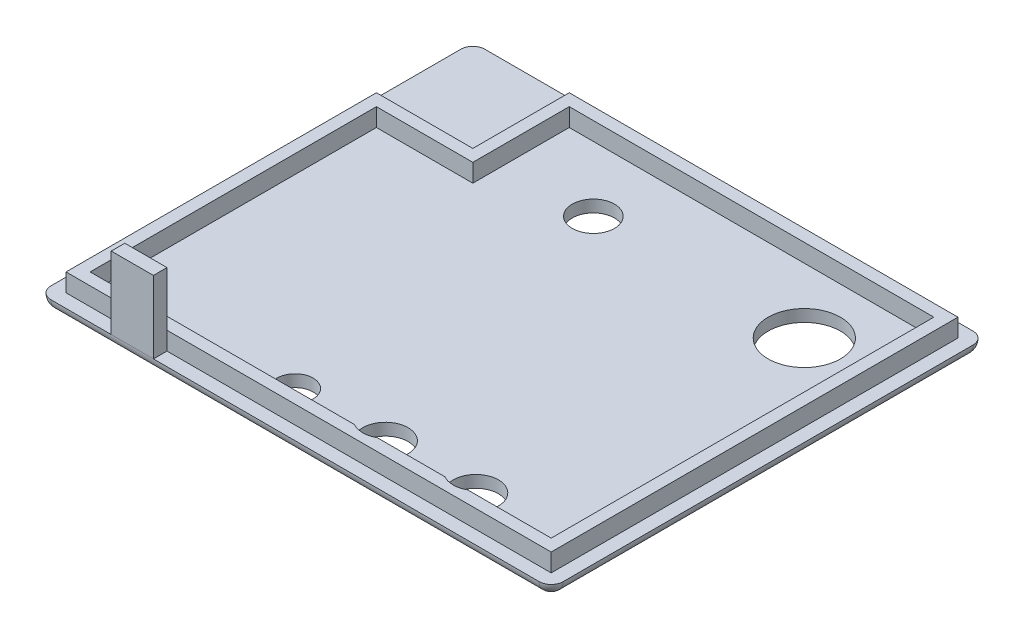
ISO-10303-21;
HEADER;
FILE_DESCRIPTION(('STEP AP214'),'2;1');
FILE_NAME('part.step','',(''),(''),'','','');
FILE_SCHEMA(('AUTOMOTIVE_DESIGN { 1 0 10303 214 1 1 1 1 }'));
ENDSEC;
DATA;
#1=APPLICATION_CONTEXT('core data for automotive mechanical design processes');
#2=APPLICATION_PROTOCOL_DEFINITION('international standard','automotive_design',2000,#1);
#3=PRODUCT_CONTEXT('',#1,'mechanical');
#4=PRODUCT('Part','Part','',(#3));
#5=PRODUCT_RELATED_PRODUCT_CATEGORY('part','',(#4));
#6=PRODUCT_DEFINITION_FORMATION('','',#4);
#7=PRODUCT_DEFINITION_CONTEXT('part definition',#1,'design');
#8=PRODUCT_DEFINITION('design','',#6,#7);
#9=PRODUCT_DEFINITION_SHAPE('','',#8);
#10=(LENGTH_UNIT() NAMED_UNIT(*) SI_UNIT(.MILLI.,.METRE.));
#11=(NAMED_UNIT(*) PLANE_ANGLE_UNIT() SI_UNIT($,.RADIAN.));
#12=(NAMED_UNIT(*) SI_UNIT($,.STERADIAN.) SOLID_ANGLE_UNIT());
#13=UNCERTAINTY_MEASURE_WITH_UNIT(LENGTH_MEASURE(1.E-05),#10,'distance_accuracy_value','');
#14=(GEOMETRIC_REPRESENTATION_CONTEXT(3) GLOBAL_UNCERTAINTY_ASSIGNED_CONTEXT((#13)) GLOBAL_UNIT_ASSIGNED_CONTEXT((#10,
#11,#12)) REPRESENTATION_CONTEXT('',''));
#15=CARTESIAN_POINT('',(0.,0.,0.));
#16=DIRECTION('',(0.,0.,1.));
#17=DIRECTION('',(1.,0.,0.));
#18=AXIS2_PLACEMENT_3D('',#15,#16,#17);
#19=CARTESIAN_POINT('',(0.,2.,0.));
#20=DIRECTION('',(0.,1.,0.));
#21=DIRECTION('',(0.,0.,1.));
#22=AXIS2_PLACEMENT_3D('',#19,#20,#21);
#23=PLANE('',#22);
#24=DIRECTION('',(1.,0.,0.));
#25=VECTOR('',#24,1.);
#26=CARTESIAN_POINT('',(-42.5,2.,36.));
#27=LINE('',#26,#25);
#28=CARTESIAN_POINT('',(-23.5,2.,36.));
#29=VERTEX_POINT('',#28);
#30=CARTESIAN_POINT('',(40.5,2.,36.));
#31=VERTEX_POINT('',#30);
#32=EDGE_CURVE('E385',#29,#31,#27,.T.);
#33=ORIENTED_EDGE('',*,*,#32,.T.);
#34=CARTESIAN_POINT('',(40.5,2.,34.));
#35=DIRECTION('',(0.,1.,0.));
#36=DIRECTION('',(0.,0.,1.));
#37=AXIS2_PLACEMENT_3D('',#34,#35,#36);
#38=CIRCLE('',#37,2.);
#39=CARTESIAN_POINT('',(42.5,2.,34.));
#40=VERTEX_POINT('',#39);
#41=EDGE_CURVE('E409',#31,#40,#38,.T.);
#42=ORIENTED_EDGE('',*,*,#41,.T.);
#43=DIRECTION('',(0.,0.,-1.));
#44=VECTOR('',#43,1.);
#45=CARTESIAN_POINT('',(42.5,2.,-36.));
#46=LINE('',#45,#44);
#47=CARTESIAN_POINT('',(42.5,2.,-34.));
#48=VERTEX_POINT('',#47);
#49=EDGE_CURVE('E388',#40,#48,#46,.T.);
#50=ORIENTED_EDGE('',*,*,#49,.T.);
#51=CARTESIAN_POINT('',(40.5,2.,-34.));
#52=DIRECTION('',(0.,1.,0.));
#53=DIRECTION('',(0.,0.,1.));
#54=AXIS2_PLACEMENT_3D('',#51,#52,#53);
#55=CIRCLE('',#54,2.);
#56=CARTESIAN_POINT('',(40.5,2.,-36.));
#57=VERTEX_POINT('',#56);
#58=EDGE_CURVE('E403',#48,#57,#55,.T.);
#59=ORIENTED_EDGE('',*,*,#58,.T.);
#60=DIRECTION('',(-1.,0.,0.));
#61=VECTOR('',#60,1.);
#62=CARTESIAN_POINT('',(-42.5,2.,-36.));
#63=LINE('',#62,#61);
#64=CARTESIAN_POINT('',(-40.5,2.,-36.));
#65=VERTEX_POINT('',#64);
#66=EDGE_CURVE('E390',#57,#65,#63,.T.);
#67=ORIENTED_EDGE('',*,*,#66,.T.);
#68=CARTESIAN_POINT('',(-40.5,2.,-34.));
#69=DIRECTION('',(0.,1.,0.));
#70=DIRECTION('',(0.,0.,1.));
#71=AXIS2_PLACEMENT_3D('',#68,#69,#70);
#72=CIRCLE('',#71,2.);
#73=CARTESIAN_POINT('',(-42.5,2.,-34.));
#74=VERTEX_POINT('',#73);
#75=EDGE_CURVE('E405',#65,#74,#72,.T.);
#76=ORIENTED_EDGE('',*,*,#75,.T.);
#77=DIRECTION('',(0.,0.,1.));
#78=VECTOR('',#77,1.);
#79=CARTESIAN_POINT('',(-42.5,2.,-36.));
#80=LINE('',#79,#78);
#81=CARTESIAN_POINT('',(-42.5,2.,34.));
#82=VERTEX_POINT('',#81);
#83=EDGE_CURVE('E383',#74,#82,#80,.T.);
#84=ORIENTED_EDGE('',*,*,#83,.T.);
#85=CARTESIAN_POINT('',(-40.5,2.,34.));
#86=DIRECTION('',(0.,1.,0.));
#87=DIRECTION('',(0.,0.,1.));
#88=AXIS2_PLACEMENT_3D('',#85,#86,#87);
#89=CIRCLE('',#88,2.);
#90=CARTESIAN_POINT('',(-40.5,2.,36.));
#91=VERTEX_POINT('',#90);
#92=EDGE_CURVE('E407',#82,#91,#89,.T.);
#93=ORIENTED_EDGE('',*,*,#92,.T.);
#94=CARTESIAN_POINT('',(-30.5,2.,36.));
#95=VERTEX_POINT('',#94);
#96=EDGE_CURVE('E386',#91,#95,#27,.T.);
#97=ORIENTED_EDGE('',*,*,#96,.T.);
#98=DIRECTION('',(0.,0.,1.));
#99=VECTOR('',#98,1.);
#100=CARTESIAN_POINT('',(-30.5,2.,33.75));
#101=LINE('',#100,#99);
#102=CARTESIAN_POINT('',(-30.5,2.,33.75));
#103=VERTEX_POINT('',#102);
#104=EDGE_CURVE('E243',#103,#95,#101,.T.);
#105=ORIENTED_EDGE('',*,*,#104,.F.);
#106=DIRECTION('',(1.,0.,0.));
#107=VECTOR('',#106,1.);
#108=CARTESIAN_POINT('',(40.25,2.,33.75));
#109=LINE('',#108,#107);
#110=CARTESIAN_POINT('',(-40.25,2.,33.75));
#111=VERTEX_POINT('',#110);
#112=EDGE_CURVE('E340',#111,#103,#109,.T.);
#113=ORIENTED_EDGE('',*,*,#112,.F.);
#114=DIRECTION('',(0.,0.,1.));
#115=VECTOR('',#114,1.);
#116=CARTESIAN_POINT('',(-40.25,2.,-17.75));
#117=LINE('',#116,#115);
#118=CARTESIAN_POINT('',(-40.25,2.,-17.75));
#119=VERTEX_POINT('',#118);
#120=EDGE_CURVE('E362',#119,#111,#117,.T.);
#121=ORIENTED_EDGE('',*,*,#120,.F.);
#122=DIRECTION('',(-1.,0.,0.));
#123=VECTOR('',#122,1.);
#124=CARTESIAN_POINT('',(-24.25,2.,-17.75));
#125=LINE('',#124,#123);
#126=CARTESIAN_POINT('',(-24.25,2.,-17.75));
#127=VERTEX_POINT('',#126);
#128=EDGE_CURVE('E360',#127,#119,#125,.T.);
#129=ORIENTED_EDGE('',*,*,#128,.F.);
#130=DIRECTION('',(0.,0.,1.));
#131=VECTOR('',#130,1.);
#132=CARTESIAN_POINT('',(-24.25,2.,-33.75));
#133=LINE('',#132,#131);
#134=CARTESIAN_POINT('',(-24.25,2.,-33.75));
#135=VERTEX_POINT('',#134);
#136=EDGE_CURVE('E358',#135,#127,#133,.T.);
#137=ORIENTED_EDGE('',*,*,#136,.F.);
#138=DIRECTION('',(-1.,0.,0.));
#139=VECTOR('',#138,1.);
#140=CARTESIAN_POINT('',(-24.25,2.,-33.75));
#141=LINE('',#140,#139);
#142=CARTESIAN_POINT('',(40.25,2.,-33.75));
#143=VERTEX_POINT('',#142);
#144=EDGE_CURVE('E356',#143,#135,#141,.T.);
#145=ORIENTED_EDGE('',*,*,#144,.F.);
#146=DIRECTION('',(0.,0.,-1.));
#147=VECTOR('',#146,1.);
#148=CARTESIAN_POINT('',(40.25,2.,-33.75));
#149=LINE('',#148,#147);
#150=CARTESIAN_POINT('',(40.25,2.,33.75));
#151=VERTEX_POINT('',#150);
#152=EDGE_CURVE('E335',#151,#143,#149,.T.);
#153=ORIENTED_EDGE('',*,*,#152,.F.);
#154=CARTESIAN_POINT('',(-23.5,2.,33.75));
#155=VERTEX_POINT('',#154);
#156=EDGE_CURVE('E365',#155,#151,#109,.T.);
#157=ORIENTED_EDGE('',*,*,#156,.F.);
#158=DIRECTION('',(0.,0.,-1.));
#159=VECTOR('',#158,1.);
#160=CARTESIAN_POINT('',(-23.5,2.,33.75));
#161=LINE('',#160,#159);
#162=EDGE_CURVE('E239',#29,#155,#161,.T.);
#163=ORIENTED_EDGE('',*,*,#162,.F.);
#164=EDGE_LOOP('',(#33,#42,#50,#59,#67,#76,#84,#93,#97,#105,#113,#121,#129,#137,#145,#153,#157,#163));
#165=FACE_BOUND('',#164,.T.);
#166=ADVANCED_FACE('F37',(#165),#23,.T.);
#167=CARTESIAN_POINT('',(40.25,5.,33.75));
#168=DIRECTION('',(0.,0.,-1.));
#169=DIRECTION('',(-1.,0.,0.));
#170=AXIS2_PLACEMENT_3D('',#167,#168,#169);
#171=PLANE('',#170);
#172=DIRECTION('',(0.,-1.,0.));
#173=VECTOR('',#172,1.);
#174=CARTESIAN_POINT('',(-30.5,5.,33.75));
#175=LINE('',#174,#173);
#176=CARTESIAN_POINT('',(-30.5,5.,33.75));
#177=VERTEX_POINT('',#176);
#178=EDGE_CURVE('E401',#177,#103,#175,.T.);
#179=ORIENTED_EDGE('',*,*,#178,.F.);
#180=DIRECTION('',(1.,0.,0.));
#181=VECTOR('',#180,1.);
#182=CARTESIAN_POINT('',(40.25,5.,33.75));
#183=LINE('',#182,#181);
#184=CARTESIAN_POINT('',(-40.25,5.,33.75));
#185=VERTEX_POINT('',#184);
#186=EDGE_CURVE('E349',#185,#177,#183,.T.);
#187=ORIENTED_EDGE('',*,*,#186,.F.);
#188=DIRECTION('',(0.,-1.,0.));
#189=VECTOR('',#188,1.);
#190=CARTESIAN_POINT('',(-40.25,5.,33.75));
#191=LINE('',#190,#189);
#192=EDGE_CURVE('E370',#185,#111,#191,.T.);
#193=ORIENTED_EDGE('',*,*,#192,.T.);
#194=ORIENTED_EDGE('',*,*,#112,.T.);
#195=EDGE_LOOP('',(#179,#187,#193,#194));
#196=FACE_BOUND('',#195,.T.);
#197=ADVANCED_FACE('F477',(#196),#171,.F.);
#198=DIRECTION('',(0.,1.,0.));
#199=VECTOR('',#198,1.);
#200=CARTESIAN_POINT('',(-23.5,5.,33.75));
#201=LINE('',#200,#199);
#202=CARTESIAN_POINT('',(-23.5,5.,33.75));
#203=VERTEX_POINT('',#202);
#204=EDGE_CURVE('E398',#155,#203,#201,.T.);
#205=ORIENTED_EDGE('',*,*,#204,.F.);
#206=ORIENTED_EDGE('',*,*,#156,.T.);
#207=DIRECTION('',(0.,-1.,0.));
#208=VECTOR('',#207,1.);
#209=CARTESIAN_POINT('',(40.25,5.,33.75));
#210=LINE('',#209,#208);
#211=CARTESIAN_POINT('',(40.25,5.,33.75));
#212=VERTEX_POINT('',#211);
#213=EDGE_CURVE('E352',#212,#151,#210,.T.);
#214=ORIENTED_EDGE('',*,*,#213,.F.);
#215=EDGE_CURVE('E348',#203,#212,#183,.T.);
#216=ORIENTED_EDGE('',*,*,#215,.F.);
#217=EDGE_LOOP('',(#205,#206,#214,#216));
#218=FACE_BOUND('',#217,.T.);
#219=ADVANCED_FACE('F459',(#218),#171,.F.);
#220=CARTESIAN_POINT('',(-38.25,5.,31.75));
#221=DIRECTION('',(0.,0.,-1.));
#222=DIRECTION('',(-1.,0.,0.));
#223=AXIS2_PLACEMENT_3D('',#220,#221,#222);
#224=PLANE('',#223);
#225=DIRECTION('',(0.,-1.,0.));
#226=VECTOR('',#225,1.);
#227=CARTESIAN_POINT('',(24.370828693387,5.,31.75));
#228=LINE('',#227,#226);
#229=CARTESIAN_POINT('',(24.370828693387,5.,31.75));
#230=VERTEX_POINT('',#229);
#231=CARTESIAN_POINT('',(24.370828693387,2.,31.75));
#232=VERTEX_POINT('',#231);
#233=EDGE_CURVE('E284',#230,#232,#228,.T.);
#234=ORIENTED_EDGE('',*,*,#233,.F.);
#235=DIRECTION('',(1.,0.,0.));
#236=VECTOR('',#235,1.);
#237=CARTESIAN_POINT('',(-38.25,5.,31.75));
#238=LINE('',#237,#236);
#239=CARTESIAN_POINT('',(38.25,5.,31.75));
#240=VERTEX_POINT('',#239);
#241=EDGE_CURVE('E289',#230,#240,#238,.T.);
#242=ORIENTED_EDGE('',*,*,#241,.T.);
#243=DIRECTION('',(0.,-1.,0.));
#244=VECTOR('',#243,1.);
#245=CARTESIAN_POINT('',(38.25,5.,31.75));
#246=LINE('',#245,#244);
#247=CARTESIAN_POINT('',(38.25,2.,31.75));
#248=VERTEX_POINT('',#247);
#249=EDGE_CURVE('E329',#240,#248,#246,.T.);
#250=ORIENTED_EDGE('',*,*,#249,.T.);
#251=DIRECTION('',(1.,0.,0.));
#252=VECTOR('',#251,1.);
#253=CARTESIAN_POINT('',(-38.25,2.,31.75));
#254=LINE('',#253,#252);
#255=EDGE_CURVE('E306',#232,#248,#254,.T.);
#256=ORIENTED_EDGE('',*,*,#255,.F.);
#257=EDGE_LOOP('',(#234,#242,#250,#256));
#258=FACE_BOUND('',#257,.T.);
#259=ADVANCED_FACE('F599',(#258),#224,.T.);
#260=DIRECTION('',(0.,-1.,0.));
#261=VECTOR('',#260,1.);
#262=CARTESIAN_POINT('',(20.629171306613,5.,31.75));
#263=LINE('',#262,#261);
#264=CARTESIAN_POINT('',(20.629171306613,2.,31.75));
#265=VERTEX_POINT('',#264);
#266=CARTESIAN_POINT('',(20.629171306613,5.,31.75));
#267=VERTEX_POINT('',#266);
#268=EDGE_CURVE('E282',#265,#267,#263,.F.);
#269=ORIENTED_EDGE('',*,*,#268,.F.);
#270=CARTESIAN_POINT('',(9.37082869338696,2.,31.75));
#271=VERTEX_POINT('',#270);
#272=EDGE_CURVE('E311',#271,#265,#254,.T.);
#273=ORIENTED_EDGE('',*,*,#272,.F.);
#274=DIRECTION('',(0.,-1.,0.));
#275=VECTOR('',#274,1.);
#276=CARTESIAN_POINT('',(9.37082869338696,5.,31.75));
#277=LINE('',#276,#275);
#278=CARTESIAN_POINT('',(9.37082869338696,5.,31.75));
#279=VERTEX_POINT('',#278);
#280=EDGE_CURVE('E280',#279,#271,#277,.T.);
#281=ORIENTED_EDGE('',*,*,#280,.F.);
#282=EDGE_CURVE('E295',#279,#267,#238,.T.);
#283=ORIENTED_EDGE('',*,*,#282,.T.);
#284=EDGE_LOOP('',(#269,#273,#281,#283));
#285=FACE_BOUND('',#284,.T.);
#286=ADVANCED_FACE('F541',(#285),#224,.T.);
#287=CARTESIAN_POINT('',(-42.5,2.,36.));
#288=DIRECTION('',(0.,0.,-1.));
#289=DIRECTION('',(-1.,0.,0.));
#290=AXIS2_PLACEMENT_3D('',#287,#288,#289);
#291=PLANE('',#290);
#292=DIRECTION('',(0.,-1.,0.));
#293=VECTOR('',#292,1.);
#294=CARTESIAN_POINT('',(-30.5,14.,36.));
#295=LINE('',#294,#293);
#296=CARTESIAN_POINT('',(-30.5,14.,36.));
#297=VERTEX_POINT('',#296);
#298=EDGE_CURVE('E223',#297,#95,#295,.T.);
#299=ORIENTED_EDGE('',*,*,#298,.T.);
#300=DIRECTION('',(1.,0.,0.));
#301=VECTOR('',#300,1.);
#302=CARTESIAN_POINT('',(-42.5,2.,36.));
#303=LINE('',#302,#301);
#304=EDGE_CURVE('E412',#95,#29,#303,.T.);
#305=ORIENTED_EDGE('',*,*,#304,.T.);
#306=DIRECTION('',(0.,-1.,0.));
#307=VECTOR('',#306,1.);
#308=CARTESIAN_POINT('',(-23.5,14.,36.));
#309=LINE('',#308,#307);
#310=CARTESIAN_POINT('',(-23.5,14.,36.));
#311=VERTEX_POINT('',#310);
#312=EDGE_CURVE('E226',#311,#29,#309,.T.);
#313=ORIENTED_EDGE('',*,*,#312,.F.);
#314=DIRECTION('',(1.,0.,0.));
#315=VECTOR('',#314,1.);
#316=CARTESIAN_POINT('',(-30.5,14.,36.));
#317=LINE('',#316,#315);
#318=EDGE_CURVE('E219',#297,#311,#317,.T.);
#319=ORIENTED_EDGE('',*,*,#318,.F.);
#320=EDGE_LOOP('',(#299,#305,#313,#319));
#321=FACE_BOUND('',#320,.T.);
#322=ADVANCED_FACE('F221',(#321),#291,.F.);
#323=CARTESIAN_POINT('',(0.,0.,0.));
#324=DIRECTION('',(0.,1.,0.));
#325=DIRECTION('',(0.,0.,1.));
#326=AXIS2_PLACEMENT_3D('',#323,#324,#325);
#327=PLANE('',#326);
#328=DIRECTION('',(0.,0.,-1.));
#329=VECTOR('',#328,1.);
#330=CARTESIAN_POINT('',(40.5,0.,0.));
#331=LINE('',#330,#329);
#332=CARTESIAN_POINT('',(40.5,0.,-34.));
#333=VERTEX_POINT('',#332);
#334=CARTESIAN_POINT('',(40.5,0.,34.));
#335=VERTEX_POINT('',#334);
#336=EDGE_CURVE('E414',#333,#335,#331,.F.);
#337=ORIENTED_EDGE('',*,*,#336,.T.);
#338=DIRECTION('',(1.,0.,0.));
#339=VECTOR('',#338,1.);
#340=CARTESIAN_POINT('',(0.,0.,34.));
#341=LINE('',#340,#339);
#342=CARTESIAN_POINT('',(-40.5,0.,34.));
#343=VERTEX_POINT('',#342);
#344=EDGE_CURVE('E11',#335,#343,#341,.F.);
#345=ORIENTED_EDGE('',*,*,#344,.T.);
#346=DIRECTION('',(0.,0.,1.));
#347=VECTOR('',#346,1.);
#348=CARTESIAN_POINT('',(-40.5,0.,0.));
#349=LINE('',#348,#347);
#350=CARTESIAN_POINT('',(-40.5,0.,-34.));
#351=VERTEX_POINT('',#350);
#352=EDGE_CURVE('E46',#343,#351,#349,.F.);
#353=ORIENTED_EDGE('',*,*,#352,.T.);
#354=DIRECTION('',(-1.,0.,0.));
#355=VECTOR('',#354,1.);
#356=CARTESIAN_POINT('',(0.,0.,-34.));
#357=LINE('',#356,#355);
#358=EDGE_CURVE('E416',#351,#333,#357,.F.);
#359=ORIENTED_EDGE('',*,*,#358,.T.);
#360=EDGE_LOOP('',(#337,#345,#353,#359));
#361=FACE_BOUND('',#360,.T.);
#362=CARTESIAN_POINT('',(27.5,0.,-21.));
#363=DIRECTION('',(0.,-1.,0.));
#364=DIRECTION('',(0.,0.,-1.));
#365=AXIS2_PLACEMENT_3D('',#362,#363,#364);
#366=CIRCLE('',#365,6.);
#367=CARTESIAN_POINT('',(27.5,0.,-27.));
#368=VERTEX_POINT('',#367);
#369=EDGE_CURVE('E258',#368,#368,#366,.T.);
#370=ORIENTED_EDGE('',*,*,#369,.F.);
#371=EDGE_LOOP('',(#370));
#372=FACE_BOUND('',#371,.T.);
#373=CARTESIAN_POINT('',(-7.5,0.,-21.));
#374=DIRECTION('',(0.,-1.,0.));
#375=DIRECTION('',(0.,0.,-1.));
#376=AXIS2_PLACEMENT_3D('',#373,#374,#375);
#377=CIRCLE('',#376,3.5);
#378=CARTESIAN_POINT('',(-7.5,0.,-24.5));
#379=VERTEX_POINT('',#378);
#380=EDGE_CURVE('E248',#379,#379,#377,.T.);
#381=ORIENTED_EDGE('',*,*,#380,.F.);
#382=EDGE_LOOP('',(#381));
#383=FACE_BOUND('',#382,.T.);
#384=CARTESIAN_POINT('',(22.5,0.,28.5));
#385=DIRECTION('',(0.,-1.,0.));
#386=DIRECTION('',(0.,0.,-1.));
#387=AXIS2_PLACEMENT_3D('',#384,#385,#386);
#388=CIRCLE('',#387,3.75);
#389=CARTESIAN_POINT('',(22.5,0.,24.75));
#390=VERTEX_POINT('',#389);
#391=EDGE_CURVE('E267',#390,#390,#388,.T.);
#392=ORIENTED_EDGE('',*,*,#391,.F.);
#393=EDGE_LOOP('',(#392));
#394=FACE_BOUND('',#393,.T.);
#395=CARTESIAN_POINT('',(7.5,0.,28.5));
#396=DIRECTION('',(0.,-1.,0.));
#397=DIRECTION('',(0.,0.,-1.));
#398=AXIS2_PLACEMENT_3D('',#395,#396,#397);
#399=CIRCLE('',#398,3.75);
#400=CARTESIAN_POINT('',(7.5,0.,24.75));
#401=VERTEX_POINT('',#400);
#402=EDGE_CURVE('E270',#401,#401,#399,.T.);
#403=ORIENTED_EDGE('',*,*,#402,.F.);
#404=EDGE_LOOP('',(#403));
#405=FACE_BOUND('',#404,.T.);
#406=CARTESIAN_POINT('',(-7.5,0.,28.5));
#407=DIRECTION('',(0.,-1.,0.));
#408=DIRECTION('',(0.,0.,-1.));
#409=AXIS2_PLACEMENT_3D('',#406,#407,#408);
#410=CIRCLE('',#409,3.);
#411=CARTESIAN_POINT('',(-7.5,0.,25.5));
#412=VERTEX_POINT('',#411);
#413=EDGE_CURVE('E257',#412,#412,#410,.T.);
#414=ORIENTED_EDGE('',*,*,#413,.F.);
#415=EDGE_LOOP('',(#414));
#416=FACE_BOUND('',#415,.T.);
#417=ADVANCED_FACE('F500',(#361,#372,#383,#394,#405,#416),#327,.F.);
#418=CARTESIAN_POINT('',(0.,5.,0.));
#419=DIRECTION('',(0.,-1.,0.));
#420=DIRECTION('',(0.,0.,-1.));
#421=AXIS2_PLACEMENT_3D('',#418,#419,#420);
#422=PLANE('',#421);
#423=DIRECTION('',(0.,0.,-1.));
#424=VECTOR('',#423,1.);
#425=CARTESIAN_POINT('',(40.25,5.,-33.75));
#426=LINE('',#425,#424);
#427=CARTESIAN_POINT('',(40.25,5.,-33.75));
#428=VERTEX_POINT('',#427);
#429=EDGE_CURVE('E336',#212,#428,#426,.T.);
#430=ORIENTED_EDGE('',*,*,#429,.T.);
#431=DIRECTION('',(-1.,0.,0.));
#432=VECTOR('',#431,1.);
#433=CARTESIAN_POINT('',(-24.25,5.,-33.75));
#434=LINE('',#433,#432);
#435=CARTESIAN_POINT('',(-24.25,5.,-33.75));
#436=VERTEX_POINT('',#435);
#437=EDGE_CURVE('E339',#428,#436,#434,.T.);
#438=ORIENTED_EDGE('',*,*,#437,.T.);
#439=DIRECTION('',(0.,0.,1.));
#440=VECTOR('',#439,1.);
#441=CARTESIAN_POINT('',(-24.25,5.,-33.75));
#442=LINE('',#441,#440);
#443=CARTESIAN_POINT('',(-24.25,5.,-17.75));
#444=VERTEX_POINT('',#443);
#445=EDGE_CURVE('E342',#436,#444,#442,.T.);
#446=ORIENTED_EDGE('',*,*,#445,.T.);
#447=DIRECTION('',(-1.,0.,0.));
#448=VECTOR('',#447,1.);
#449=CARTESIAN_POINT('',(-24.25,5.,-17.75));
#450=LINE('',#449,#448);
#451=CARTESIAN_POINT('',(-40.25,5.,-17.75));
#452=VERTEX_POINT('',#451);
#453=EDGE_CURVE('E344',#444,#452,#450,.T.);
#454=ORIENTED_EDGE('',*,*,#453,.T.);
#455=DIRECTION('',(0.,0.,1.));
#456=VECTOR('',#455,1.);
#457=CARTESIAN_POINT('',(-40.25,5.,-17.75));
#458=LINE('',#457,#456);
#459=EDGE_CURVE('E346',#452,#185,#458,.T.);
#460=ORIENTED_EDGE('',*,*,#459,.T.);
#461=ORIENTED_EDGE('',*,*,#186,.T.);
#462=EDGE_CURVE('E353',#177,#203,#183,.T.);
#463=ORIENTED_EDGE('',*,*,#462,.T.);
#464=ORIENTED_EDGE('',*,*,#215,.T.);
#465=EDGE_LOOP('',(#430,#438,#446,#454,#460,#461,#463,#464));
#466=FACE_BOUND('',#465,.T.);
#467=ORIENTED_EDGE('',*,*,#241,.F.);
#468=CARTESIAN_POINT('',(22.5,5.,28.5));
#469=DIRECTION('',(0.,-1.,0.));
#470=DIRECTION('',(0.,0.,-1.));
#471=AXIS2_PLACEMENT_3D('',#468,#469,#470);
#472=CIRCLE('',#471,3.75);
#473=EDGE_CURVE('E263',#230,#267,#472,.T.);
#474=ORIENTED_EDGE('',*,*,#473,.T.);
#475=ORIENTED_EDGE('',*,*,#282,.F.);
#476=CARTESIAN_POINT('',(7.5,5.,28.5));
#477=DIRECTION('',(0.,-1.,0.));
#478=DIRECTION('',(0.,0.,-1.));
#479=AXIS2_PLACEMENT_3D('',#476,#477,#478);
#480=CIRCLE('',#479,3.75);
#481=CARTESIAN_POINT('',(5.62917130661304,5.,31.75));
#482=VERTEX_POINT('',#481);
#483=EDGE_CURVE('E273',#279,#482,#480,.T.);
#484=ORIENTED_EDGE('',*,*,#483,.T.);
#485=CARTESIAN_POINT('',(-38.25,5.,31.75));
#486=VERTEX_POINT('',#485);
#487=EDGE_CURVE('E291',#486,#482,#238,.T.);
#488=ORIENTED_EDGE('',*,*,#487,.F.);
#489=DIRECTION('',(0.,0.,1.));
#490=VECTOR('',#489,1.);
#491=CARTESIAN_POINT('',(-38.25,5.,-15.75));
#492=LINE('',#491,#490);
#493=CARTESIAN_POINT('',(-38.25,5.,-15.75));
#494=VERTEX_POINT('',#493);
#495=EDGE_CURVE('E287',#494,#486,#492,.T.);
#496=ORIENTED_EDGE('',*,*,#495,.F.);
#497=DIRECTION('',(-1.,0.,0.));
#498=VECTOR('',#497,1.);
#499=CARTESIAN_POINT('',(-22.25,5.,-15.75));
#500=LINE('',#499,#498);
#501=CARTESIAN_POINT('',(-22.25,5.,-15.75));
#502=VERTEX_POINT('',#501);
#503=EDGE_CURVE('E302',#502,#494,#500,.T.);
#504=ORIENTED_EDGE('',*,*,#503,.F.);
#505=DIRECTION('',(0.,0.,1.));
#506=VECTOR('',#505,1.);
#507=CARTESIAN_POINT('',(-22.25,5.,-31.75));
#508=LINE('',#507,#506);
#509=CARTESIAN_POINT('',(-22.25,5.,-31.75));
#510=VERTEX_POINT('',#509);
#511=EDGE_CURVE('E299',#510,#502,#508,.T.);
#512=ORIENTED_EDGE('',*,*,#511,.F.);
#513=DIRECTION('',(-1.,0.,0.));
#514=VECTOR('',#513,1.);
#515=CARTESIAN_POINT('',(38.25,5.,-31.75));
#516=LINE('',#515,#514);
#517=CARTESIAN_POINT('',(38.25,5.,-31.75));
#518=VERTEX_POINT('',#517);
#519=EDGE_CURVE('E297',#518,#510,#516,.T.);
#520=ORIENTED_EDGE('',*,*,#519,.F.);
#521=DIRECTION('',(0.,0.,-1.));
#522=VECTOR('',#521,1.);
#523=CARTESIAN_POINT('',(38.25,5.,31.75));
#524=LINE('',#523,#522);
#525=EDGE_CURVE('E294',#240,#518,#524,.T.);
#526=ORIENTED_EDGE('',*,*,#525,.F.);
#527=EDGE_LOOP('',(#467,#474,#475,#484,#488,#496,#504,#512,#520,#526));
#528=FACE_BOUND('',#527,.T.);
#529=ADVANCED_FACE('F470',(#466,#528),#422,.F.);
#530=CARTESIAN_POINT('',(40.25,5.,-33.75));
#531=DIRECTION('',(-1.,0.,0.));
#532=DIRECTION('',(0.,0.,1.));
#533=AXIS2_PLACEMENT_3D('',#530,#531,#532);
#534=PLANE('',#533);
#535=ORIENTED_EDGE('',*,*,#152,.T.);
#536=DIRECTION('',(0.,-1.,0.));
#537=VECTOR('',#536,1.);
#538=CARTESIAN_POINT('',(40.25,5.,-33.75));
#539=LINE('',#538,#537);
#540=EDGE_CURVE('E381',#428,#143,#539,.T.);
#541=ORIENTED_EDGE('',*,*,#540,.F.);
#542=ORIENTED_EDGE('',*,*,#429,.F.);
#543=ORIENTED_EDGE('',*,*,#213,.T.);
#544=EDGE_LOOP('',(#535,#541,#542,#543));
#545=FACE_BOUND('',#544,.T.);
#546=ADVANCED_FACE('F467',(#545),#534,.F.);
#547=CARTESIAN_POINT('',(-24.25,5.,-33.75));
#548=DIRECTION('',(0.,0.,1.));
#549=DIRECTION('',(1.,0.,0.));
#550=AXIS2_PLACEMENT_3D('',#547,#548,#549);
#551=PLANE('',#550);
#552=ORIENTED_EDGE('',*,*,#144,.T.);
#553=DIRECTION('',(0.,-1.,0.));
#554=VECTOR('',#553,1.);
#555=CARTESIAN_POINT('',(-24.25,5.,-33.75));
#556=LINE('',#555,#554);
#557=EDGE_CURVE('E378',#436,#135,#556,.T.);
#558=ORIENTED_EDGE('',*,*,#557,.F.);
#559=ORIENTED_EDGE('',*,*,#437,.F.);
#560=ORIENTED_EDGE('',*,*,#540,.T.);
#561=EDGE_LOOP('',(#552,#558,#559,#560));
#562=FACE_BOUND('',#561,.T.);
#563=ADVANCED_FACE('F661',(#562),#551,.F.);
#564=CARTESIAN_POINT('',(-24.25,5.,-33.75));
#565=DIRECTION('',(1.,0.,0.));
#566=DIRECTION('',(0.,0.,-1.));
#567=AXIS2_PLACEMENT_3D('',#564,#565,#566);
#568=PLANE('',#567);
#569=ORIENTED_EDGE('',*,*,#136,.T.);
#570=DIRECTION('',(0.,-1.,0.));
#571=VECTOR('',#570,1.);
#572=CARTESIAN_POINT('',(-24.25,5.,-17.75));
#573=LINE('',#572,#571);
#574=EDGE_CURVE('E375',#444,#127,#573,.T.);
#575=ORIENTED_EDGE('',*,*,#574,.F.);
#576=ORIENTED_EDGE('',*,*,#445,.F.);
#577=ORIENTED_EDGE('',*,*,#557,.T.);
#578=EDGE_LOOP('',(#569,#575,#576,#577));
#579=FACE_BOUND('',#578,.T.);
#580=ADVANCED_FACE('F658',(#579),#568,.F.);
#581=CARTESIAN_POINT('',(-24.25,5.,-17.75));
#582=DIRECTION('',(0.,0.,1.));
#583=DIRECTION('',(1.,0.,0.));
#584=AXIS2_PLACEMENT_3D('',#581,#582,#583);
#585=PLANE('',#584);
#586=ORIENTED_EDGE('',*,*,#128,.T.);
#587=DIRECTION('',(0.,-1.,0.));
#588=VECTOR('',#587,1.);
#589=CARTESIAN_POINT('',(-40.25,5.,-17.75));
#590=LINE('',#589,#588);
#591=EDGE_CURVE('E372',#452,#119,#590,.T.);
#592=ORIENTED_EDGE('',*,*,#591,.F.);
#593=ORIENTED_EDGE('',*,*,#453,.F.);
#594=ORIENTED_EDGE('',*,*,#574,.T.);
#595=EDGE_LOOP('',(#586,#592,#593,#594));
#596=FACE_BOUND('',#595,.T.);
#597=ADVANCED_FACE('F650',(#596),#585,.F.);
#598=CARTESIAN_POINT('',(-40.25,5.,-17.75));
#599=DIRECTION('',(1.,0.,0.));
#600=DIRECTION('',(0.,0.,-1.));
#601=AXIS2_PLACEMENT_3D('',#598,#599,#600);
#602=PLANE('',#601);
#603=ORIENTED_EDGE('',*,*,#120,.T.);
#604=ORIENTED_EDGE('',*,*,#192,.F.);
#605=ORIENTED_EDGE('',*,*,#459,.F.);
#606=ORIENTED_EDGE('',*,*,#591,.T.);
#607=EDGE_LOOP('',(#603,#604,#605,#606));
#608=FACE_BOUND('',#607,.T.);
#609=ADVANCED_FACE('F646',(#608),#602,.F.);
#610=CARTESIAN_POINT('',(-38.25,5.,-15.75));
#611=DIRECTION('',(1.,0.,0.));
#612=DIRECTION('',(0.,0.,-1.));
#613=AXIS2_PLACEMENT_3D('',#610,#611,#612);
#614=PLANE('',#613);
#615=DIRECTION('',(0.,0.,1.));
#616=VECTOR('',#615,1.);
#617=CARTESIAN_POINT('',(-38.25,2.,-15.75));
#618=LINE('',#617,#616);
#619=CARTESIAN_POINT('',(-38.25,2.,-15.75));
#620=VERTEX_POINT('',#619);
#621=CARTESIAN_POINT('',(-38.25,2.,31.75));
#622=VERTEX_POINT('',#621);
#623=EDGE_CURVE('E286',#620,#622,#618,.T.);
#624=ORIENTED_EDGE('',*,*,#623,.F.);
#625=DIRECTION('',(0.,-1.,0.));
#626=VECTOR('',#625,1.);
#627=CARTESIAN_POINT('',(-38.25,5.,-15.75));
#628=LINE('',#627,#626);
#629=EDGE_CURVE('E304',#494,#620,#628,.T.);
#630=ORIENTED_EDGE('',*,*,#629,.F.);
#631=ORIENTED_EDGE('',*,*,#495,.T.);
#632=DIRECTION('',(0.,-1.,0.));
#633=VECTOR('',#632,1.);
#634=CARTESIAN_POINT('',(-38.25,5.,31.75));
#635=LINE('',#634,#633);
#636=EDGE_CURVE('E332',#486,#622,#635,.T.);
#637=ORIENTED_EDGE('',*,*,#636,.T.);
#638=EDGE_LOOP('',(#624,#630,#631,#637));
#639=FACE_BOUND('',#638,.T.);
#640=ADVANCED_FACE('F622',(#639),#614,.T.);
#641=DIRECTION('',(0.,-1.,0.));
#642=VECTOR('',#641,1.);
#643=CARTESIAN_POINT('',(5.62917130661304,5.,31.75));
#644=LINE('',#643,#642);
#645=CARTESIAN_POINT('',(5.62917130661304,2.,31.75));
#646=VERTEX_POINT('',#645);
#647=EDGE_CURVE('E278',#646,#482,#644,.F.);
#648=ORIENTED_EDGE('',*,*,#647,.F.);
#649=EDGE_CURVE('E307',#622,#646,#254,.T.);
#650=ORIENTED_EDGE('',*,*,#649,.F.);
#651=ORIENTED_EDGE('',*,*,#636,.F.);
#652=ORIENTED_EDGE('',*,*,#487,.T.);
#653=EDGE_LOOP('',(#648,#650,#651,#652));
#654=FACE_BOUND('',#653,.T.);
#655=ADVANCED_FACE('F628',(#654),#224,.T.);
#656=CARTESIAN_POINT('',(38.25,5.,31.75));
#657=DIRECTION('',(-1.,0.,0.));
#658=DIRECTION('',(0.,0.,1.));
#659=AXIS2_PLACEMENT_3D('',#656,#657,#658);
#660=PLANE('',#659);
#661=DIRECTION('',(0.,0.,-1.));
#662=VECTOR('',#661,1.);
#663=CARTESIAN_POINT('',(38.25,2.,31.75));
#664=LINE('',#663,#662);
#665=CARTESIAN_POINT('',(38.25,2.,-31.75));
#666=VERTEX_POINT('',#665);
#667=EDGE_CURVE('E310',#248,#666,#664,.T.);
#668=ORIENTED_EDGE('',*,*,#667,.F.);
#669=ORIENTED_EDGE('',*,*,#249,.F.);
#670=ORIENTED_EDGE('',*,*,#525,.T.);
#671=DIRECTION('',(0.,-1.,0.));
#672=VECTOR('',#671,1.);
#673=CARTESIAN_POINT('',(38.25,5.,-31.75));
#674=LINE('',#673,#672);
#675=EDGE_CURVE('E326',#518,#666,#674,.T.);
#676=ORIENTED_EDGE('',*,*,#675,.T.);
#677=EDGE_LOOP('',(#668,#669,#670,#676));
#678=FACE_BOUND('',#677,.T.);
#679=ADVANCED_FACE('F604',(#678),#660,.T.);
#680=CARTESIAN_POINT('',(38.25,5.,-31.75));
#681=DIRECTION('',(0.,0.,1.));
#682=DIRECTION('',(1.,0.,0.));
#683=AXIS2_PLACEMENT_3D('',#680,#681,#682);
#684=PLANE('',#683);
#685=DIRECTION('',(-1.,0.,0.));
#686=VECTOR('',#685,1.);
#687=CARTESIAN_POINT('',(38.25,2.,-31.75));
#688=LINE('',#687,#686);
#689=CARTESIAN_POINT('',(-22.25,2.,-31.75));
#690=VERTEX_POINT('',#689);
#691=EDGE_CURVE('E313',#666,#690,#688,.T.);
#692=ORIENTED_EDGE('',*,*,#691,.F.);
#693=ORIENTED_EDGE('',*,*,#675,.F.);
#694=ORIENTED_EDGE('',*,*,#519,.T.);
#695=DIRECTION('',(0.,-1.,0.));
#696=VECTOR('',#695,1.);
#697=CARTESIAN_POINT('',(-22.25,5.,-31.75));
#698=LINE('',#697,#696);
#699=EDGE_CURVE('E323',#510,#690,#698,.T.);
#700=ORIENTED_EDGE('',*,*,#699,.T.);
#701=EDGE_LOOP('',(#692,#693,#694,#700));
#702=FACE_BOUND('',#701,.T.);
#703=ADVANCED_FACE('F610',(#702),#684,.T.);
#704=CARTESIAN_POINT('',(-22.25,5.,-31.75));
#705=DIRECTION('',(1.,0.,0.));
#706=DIRECTION('',(0.,0.,-1.));
#707=AXIS2_PLACEMENT_3D('',#704,#705,#706);
#708=PLANE('',#707);
#709=DIRECTION('',(0.,0.,1.));
#710=VECTOR('',#709,1.);
#711=CARTESIAN_POINT('',(-22.25,2.,-31.75));
#712=LINE('',#711,#710);
#713=CARTESIAN_POINT('',(-22.25,2.,-15.75));
#714=VERTEX_POINT('',#713);
#715=EDGE_CURVE('E315',#690,#714,#712,.T.);
#716=ORIENTED_EDGE('',*,*,#715,.F.);
#717=ORIENTED_EDGE('',*,*,#699,.F.);
#718=ORIENTED_EDGE('',*,*,#511,.T.);
#719=DIRECTION('',(0.,-1.,0.));
#720=VECTOR('',#719,1.);
#721=CARTESIAN_POINT('',(-22.25,5.,-15.75));
#722=LINE('',#721,#720);
#723=EDGE_CURVE('E320',#502,#714,#722,.T.);
#724=ORIENTED_EDGE('',*,*,#723,.T.);
#725=EDGE_LOOP('',(#716,#717,#718,#724));
#726=FACE_BOUND('',#725,.T.);
#727=ADVANCED_FACE('F614',(#726),#708,.T.);
#728=CARTESIAN_POINT('',(-22.25,5.,-15.75));
#729=DIRECTION('',(0.,0.,1.));
#730=DIRECTION('',(1.,0.,0.));
#731=AXIS2_PLACEMENT_3D('',#728,#729,#730);
#732=PLANE('',#731);
#733=DIRECTION('',(-1.,0.,0.));
#734=VECTOR('',#733,1.);
#735=CARTESIAN_POINT('',(-22.25,2.,-15.75));
#736=LINE('',#735,#734);
#737=EDGE_CURVE('E290',#714,#620,#736,.T.);
#738=ORIENTED_EDGE('',*,*,#737,.F.);
#739=ORIENTED_EDGE('',*,*,#723,.F.);
#740=ORIENTED_EDGE('',*,*,#503,.T.);
#741=ORIENTED_EDGE('',*,*,#629,.T.);
#742=EDGE_LOOP('',(#738,#739,#740,#741));
#743=FACE_BOUND('',#742,.T.);
#744=ADVANCED_FACE('F527',(#743),#732,.T.);
#745=CARTESIAN_POINT('',(27.5,2.,-21.));
#746=DIRECTION('',(0.,-1.,0.));
#747=DIRECTION('',(0.,0.,-1.));
#748=AXIS2_PLACEMENT_3D('',#745,#746,#747);
#749=CIRCLE('',#748,6.);
#750=CARTESIAN_POINT('',(27.5,2.,-27.));
#751=VERTEX_POINT('',#750);
#752=EDGE_CURVE('E254',#751,#751,#749,.T.);
#753=ORIENTED_EDGE('',*,*,#752,.T.);
#754=EDGE_LOOP('',(#753));
#755=FACE_BOUND('',#754,.T.);
#756=CARTESIAN_POINT('',(-7.5,2.,-21.));
#757=DIRECTION('',(0.,-1.,0.));
#758=DIRECTION('',(0.,0.,-1.));
#759=AXIS2_PLACEMENT_3D('',#756,#757,#758);
#760=CIRCLE('',#759,3.5);
#761=CARTESIAN_POINT('',(-7.5,2.,-24.5));
#762=VERTEX_POINT('',#761);
#763=EDGE_CURVE('E245',#762,#762,#760,.T.);
#764=ORIENTED_EDGE('',*,*,#763,.T.);
#765=EDGE_LOOP('',(#764));
#766=FACE_BOUND('',#765,.T.);
#767=CARTESIAN_POINT('',(22.5,2.,28.5));
#768=DIRECTION('',(0.,1.,0.));
#769=DIRECTION('',(0.,0.,1.));
#770=AXIS2_PLACEMENT_3D('',#767,#768,#769);
#771=CIRCLE('',#770,3.75);
#772=EDGE_CURVE('E396',#232,#265,#771,.T.);
#773=ORIENTED_EDGE('',*,*,#772,.F.);
#774=ORIENTED_EDGE('',*,*,#255,.T.);
#775=ORIENTED_EDGE('',*,*,#667,.T.);
#776=ORIENTED_EDGE('',*,*,#691,.T.);
#777=ORIENTED_EDGE('',*,*,#715,.T.);
#778=ORIENTED_EDGE('',*,*,#737,.T.);
#779=ORIENTED_EDGE('',*,*,#623,.T.);
#780=ORIENTED_EDGE('',*,*,#649,.T.);
#781=CARTESIAN_POINT('',(7.5,2.,28.5));
#782=DIRECTION('',(0.,1.,0.));
#783=DIRECTION('',(0.,0.,1.));
#784=AXIS2_PLACEMENT_3D('',#781,#782,#783);
#785=CIRCLE('',#784,3.75);
#786=EDGE_CURVE('E392',#271,#646,#785,.T.);
#787=ORIENTED_EDGE('',*,*,#786,.F.);
#788=ORIENTED_EDGE('',*,*,#272,.T.);
#789=EDGE_LOOP('',(#773,#774,#775,#776,#777,#778,#779,#780,#787,#788));
#790=FACE_BOUND('',#789,.T.);
#791=CARTESIAN_POINT('',(-7.5,2.,28.5));
#792=DIRECTION('',(0.,1.,0.));
#793=DIRECTION('',(0.,0.,1.));
#794=AXIS2_PLACEMENT_3D('',#791,#792,#793);
#795=CIRCLE('',#794,3.);
#796=CARTESIAN_POINT('',(-7.5,2.,31.5));
#797=VERTEX_POINT('',#796);
#798=EDGE_CURVE('E266',#797,#797,#795,.T.);
#799=ORIENTED_EDGE('',*,*,#798,.F.);
#800=EDGE_LOOP('',(#799));
#801=FACE_BOUND('',#800,.T.);
#802=ADVANCED_FACE('F517',(#755,#766,#790,#801),#23,.T.);
#803=CARTESIAN_POINT('',(-7.5,5.,28.5));
#804=DIRECTION('',(0.,-1.,0.));
#805=DIRECTION('',(0.,0.,-1.));
#806=AXIS2_PLACEMENT_3D('',#803,#804,#805);
#807=CYLINDRICAL_SURFACE('',#806,3.);
#808=ORIENTED_EDGE('',*,*,#798,.T.);
#809=EDGE_LOOP('',(#808));
#810=FACE_BOUND('',#809,.T.);
#811=ORIENTED_EDGE('',*,*,#413,.T.);
#812=EDGE_LOOP('',(#811));
#813=FACE_BOUND('',#812,.T.);
#814=ADVANCED_FACE('F514',(#810,#813),#807,.F.);
#815=CARTESIAN_POINT('',(7.5,5.,28.5));
#816=DIRECTION('',(0.,-1.,0.));
#817=DIRECTION('',(0.,0.,-1.));
#818=AXIS2_PLACEMENT_3D('',#815,#816,#817);
#819=CYLINDRICAL_SURFACE('',#818,3.75);
#820=ORIENTED_EDGE('',*,*,#280,.T.);
#821=ORIENTED_EDGE('',*,*,#786,.T.);
#822=ORIENTED_EDGE('',*,*,#647,.T.);
#823=ORIENTED_EDGE('',*,*,#483,.F.);
#824=EDGE_LOOP('',(#820,#821,#822,#823));
#825=FACE_BOUND('',#824,.T.);
#826=ORIENTED_EDGE('',*,*,#402,.T.);
#827=EDGE_LOOP('',(#826));
#828=FACE_BOUND('',#827,.T.);
#829=ADVANCED_FACE('F516',(#825,#828),#819,.F.);
#830=CARTESIAN_POINT('',(22.5,5.,28.5));
#831=DIRECTION('',(0.,-1.,0.));
#832=DIRECTION('',(0.,0.,-1.));
#833=AXIS2_PLACEMENT_3D('',#830,#831,#832);
#834=CYLINDRICAL_SURFACE('',#833,3.75);
#835=ORIENTED_EDGE('',*,*,#233,.T.);
#836=ORIENTED_EDGE('',*,*,#772,.T.);
#837=ORIENTED_EDGE('',*,*,#268,.T.);
#838=ORIENTED_EDGE('',*,*,#473,.F.);
#839=EDGE_LOOP('',(#835,#836,#837,#838));
#840=FACE_BOUND('',#839,.T.);
#841=ORIENTED_EDGE('',*,*,#391,.T.);
#842=EDGE_LOOP('',(#841));
#843=FACE_BOUND('',#842,.T.);
#844=ADVANCED_FACE('F524',(#840,#843),#834,.F.);
#845=CARTESIAN_POINT('',(-7.5,2.,-21.));
#846=DIRECTION('',(0.,-1.,0.));
#847=DIRECTION('',(0.,0.,-1.));
#848=AXIS2_PLACEMENT_3D('',#845,#846,#847);
#849=CYLINDRICAL_SURFACE('',#848,3.5);
#850=ORIENTED_EDGE('',*,*,#763,.F.);
#851=EDGE_LOOP('',(#850));
#852=FACE_BOUND('',#851,.T.);
#853=ORIENTED_EDGE('',*,*,#380,.T.);
#854=EDGE_LOOP('',(#853));
#855=FACE_BOUND('',#854,.T.);
#856=ADVANCED_FACE('F578',(#852,#855),#849,.F.);
#857=CARTESIAN_POINT('',(27.5,2.,-21.));
#858=DIRECTION('',(0.,-1.,0.));
#859=DIRECTION('',(0.,0.,-1.));
#860=AXIS2_PLACEMENT_3D('',#857,#858,#859);
#861=CYLINDRICAL_SURFACE('',#860,6.);
#862=ORIENTED_EDGE('',*,*,#752,.F.);
#863=EDGE_LOOP('',(#862));
#864=FACE_BOUND('',#863,.T.);
#865=ORIENTED_EDGE('',*,*,#369,.T.);
#866=EDGE_LOOP('',(#865));
#867=FACE_BOUND('',#866,.T.);
#868=ADVANCED_FACE('F572',(#864,#867),#861,.F.);
#869=CARTESIAN_POINT('',(-30.5,14.,33.75));
#870=DIRECTION('',(0.,0.,1.));
#871=DIRECTION('',(1.,0.,0.));
#872=AXIS2_PLACEMENT_3D('',#869,#870,#871);
#873=PLANE('',#872);
#874=DIRECTION('',(0.,-1.,0.));
#875=VECTOR('',#874,1.);
#876=CARTESIAN_POINT('',(-23.5,14.,33.75));
#877=LINE('',#876,#875);
#878=CARTESIAN_POINT('',(-23.5,14.,33.75));
#879=VERTEX_POINT('',#878);
#880=EDGE_CURVE('E250',#879,#203,#877,.T.);
#881=ORIENTED_EDGE('',*,*,#880,.T.);
#882=ORIENTED_EDGE('',*,*,#462,.F.);
#883=DIRECTION('',(0.,-1.,0.));
#884=VECTOR('',#883,1.);
#885=CARTESIAN_POINT('',(-30.5,14.,33.75));
#886=LINE('',#885,#884);
#887=CARTESIAN_POINT('',(-30.5,14.,33.75));
#888=VERTEX_POINT('',#887);
#889=EDGE_CURVE('E447',#888,#177,#886,.T.);
#890=ORIENTED_EDGE('',*,*,#889,.F.);
#891=DIRECTION('',(-1.,0.,0.));
#892=VECTOR('',#891,1.);
#893=CARTESIAN_POINT('',(-30.5,14.,33.75));
#894=LINE('',#893,#892);
#895=EDGE_CURVE('E235',#879,#888,#894,.T.);
#896=ORIENTED_EDGE('',*,*,#895,.F.);
#897=EDGE_LOOP('',(#881,#882,#890,#896));
#898=FACE_BOUND('',#897,.T.);
#899=ADVANCED_FACE('F452',(#898),#873,.F.);
#900=CARTESIAN_POINT('',(-30.5,14.,33.75));
#901=DIRECTION('',(1.,0.,0.));
#902=DIRECTION('',(0.,0.,-1.));
#903=AXIS2_PLACEMENT_3D('',#900,#901,#902);
#904=PLANE('',#903);
#905=ORIENTED_EDGE('',*,*,#104,.T.);
#906=ORIENTED_EDGE('',*,*,#298,.F.);
#907=DIRECTION('',(0.,0.,1.));
#908=VECTOR('',#907,1.);
#909=CARTESIAN_POINT('',(-30.5,14.,33.75));
#910=LINE('',#909,#908);
#911=EDGE_CURVE('E230',#888,#297,#910,.T.);
#912=ORIENTED_EDGE('',*,*,#911,.F.);
#913=ORIENTED_EDGE('',*,*,#889,.T.);
#914=ORIENTED_EDGE('',*,*,#178,.T.);
#915=EDGE_LOOP('',(#905,#906,#912,#913,#914));
#916=FACE_BOUND('',#915,.T.);
#917=ADVANCED_FACE('F241',(#916),#904,.F.);
#918=CARTESIAN_POINT('',(-23.5,14.,33.75));
#919=DIRECTION('',(-1.,0.,0.));
#920=DIRECTION('',(0.,0.,1.));
#921=AXIS2_PLACEMENT_3D('',#918,#919,#920);
#922=PLANE('',#921);
#923=ORIENTED_EDGE('',*,*,#162,.T.);
#924=ORIENTED_EDGE('',*,*,#204,.T.);
#925=ORIENTED_EDGE('',*,*,#880,.F.);
#926=DIRECTION('',(0.,0.,-1.));
#927=VECTOR('',#926,1.);
#928=CARTESIAN_POINT('',(-23.5,14.,33.75));
#929=LINE('',#928,#927);
#930=EDGE_CURVE('E229',#311,#879,#929,.T.);
#931=ORIENTED_EDGE('',*,*,#930,.F.);
#932=ORIENTED_EDGE('',*,*,#312,.T.);
#933=EDGE_LOOP('',(#923,#924,#925,#931,#932));
#934=FACE_BOUND('',#933,.T.);
#935=ADVANCED_FACE('F454',(#934),#922,.F.);
#936=CARTESIAN_POINT('',(0.,14.,0.));
#937=DIRECTION('',(0.,1.,0.));
#938=DIRECTION('',(0.,0.,1.));
#939=AXIS2_PLACEMENT_3D('',#936,#937,#938);
#940=PLANE('',#939);
#941=ORIENTED_EDGE('',*,*,#911,.T.);
#942=ORIENTED_EDGE('',*,*,#318,.T.);
#943=ORIENTED_EDGE('',*,*,#930,.T.);
#944=ORIENTED_EDGE('',*,*,#895,.T.);
#945=EDGE_LOOP('',(#941,#942,#943,#944));
#946=FACE_BOUND('',#945,.T.);
#947=ADVANCED_FACE('F233',(#946),#940,.T.);
#948=CARTESIAN_POINT('',(-40.5,2.,-34.));
#949=DIRECTION('',(0.,0.,-1.));
#950=DIRECTION('',(-1.,0.,0.));
#951=AXIS2_PLACEMENT_3D('',#948,#949,#950);
#952=SPHERICAL_SURFACE('',#951,2.);
#953=CARTESIAN_POINT('',(-40.5,2.,-34.));
#954=DIRECTION('',(0.,0.,-1.));
#955=DIRECTION('',(-1.,0.,0.));
#956=AXIS2_PLACEMENT_3D('',#953,#954,#955);
#957=CIRCLE('',#956,2.);
#958=EDGE_CURVE('E432',#74,#351,#957,.F.);
#959=ORIENTED_EDGE('',*,*,#958,.F.);
#960=ORIENTED_EDGE('',*,*,#75,.F.);
#961=CARTESIAN_POINT('',(-40.5,2.,-34.));
#962=DIRECTION('',(-1.,0.,0.));
#963=DIRECTION('',(0.,0.,1.));
#964=AXIS2_PLACEMENT_3D('',#961,#962,#963);
#965=CIRCLE('',#964,2.);
#966=EDGE_CURVE('E41',#351,#65,#965,.F.);
#967=ORIENTED_EDGE('',*,*,#966,.F.);
#968=EDGE_LOOP('',(#959,#960,#967));
#969=FACE_BOUND('',#968,.T.);
#970=ADVANCED_FACE('F39',(#969),#952,.T.);
#971=CARTESIAN_POINT('',(-42.5,2.,-34.));
#972=DIRECTION('',(-1.,0.,0.));
#973=DIRECTION('',(0.,0.,1.));
#974=AXIS2_PLACEMENT_3D('',#971,#972,#973);
#975=CYLINDRICAL_SURFACE('',#974,2.);
#976=ORIENTED_EDGE('',*,*,#966,.T.);
#977=ORIENTED_EDGE('',*,*,#66,.F.);
#978=CARTESIAN_POINT('',(40.5,2.,-34.));
#979=DIRECTION('',(1.,0.,0.));
#980=DIRECTION('',(0.,0.,-1.));
#981=AXIS2_PLACEMENT_3D('',#978,#979,#980);
#982=CIRCLE('',#981,2.);
#983=EDGE_CURVE('E430',#333,#57,#982,.T.);
#984=ORIENTED_EDGE('',*,*,#983,.F.);
#985=ORIENTED_EDGE('',*,*,#358,.F.);
#986=EDGE_LOOP('',(#976,#977,#984,#985));
#987=FACE_BOUND('',#986,.T.);
#988=ADVANCED_FACE('F499',(#987),#975,.T.);
#989=CARTESIAN_POINT('',(-40.5,2.,-36.));
#990=DIRECTION('',(0.,0.,1.));
#991=DIRECTION('',(1.,0.,0.));
#992=AXIS2_PLACEMENT_3D('',#989,#990,#991);
#993=CYLINDRICAL_SURFACE('',#992,2.);
#994=ORIENTED_EDGE('',*,*,#958,.T.);
#995=ORIENTED_EDGE('',*,*,#352,.F.);
#996=CARTESIAN_POINT('',(-40.5,2.,34.));
#997=DIRECTION('',(0.,0.,1.));
#998=DIRECTION('',(1.,0.,0.));
#999=AXIS2_PLACEMENT_3D('',#996,#997,#998);
#1000=CIRCLE('',#999,2.);
#1001=EDGE_CURVE('E428',#82,#343,#1000,.T.);
#1002=ORIENTED_EDGE('',*,*,#1001,.F.);
#1003=ORIENTED_EDGE('',*,*,#83,.F.);
#1004=EDGE_LOOP('',(#994,#995,#1002,#1003));
#1005=FACE_BOUND('',#1004,.T.);
#1006=ADVANCED_FACE('F554',(#1005),#993,.T.);
#1007=CARTESIAN_POINT('',(40.5,2.,-34.));
#1008=DIRECTION('',(0.,0.,-1.));
#1009=DIRECTION('',(-1.,0.,0.));
#1010=AXIS2_PLACEMENT_3D('',#1007,#1008,#1009);
#1011=SPHERICAL_SURFACE('',#1010,2.);
#1012=ORIENTED_EDGE('',*,*,#983,.T.);
#1013=ORIENTED_EDGE('',*,*,#58,.F.);
#1014=CARTESIAN_POINT('',(40.5,2.,-34.));
#1015=DIRECTION('',(0.,0.,-1.));
#1016=DIRECTION('',(-1.,0.,0.));
#1017=AXIS2_PLACEMENT_3D('',#1014,#1015,#1016);
#1018=CIRCLE('',#1017,2.);
#1019=EDGE_CURVE('E425',#333,#48,#1018,.F.);
#1020=ORIENTED_EDGE('',*,*,#1019,.F.);
#1021=EDGE_LOOP('',(#1012,#1013,#1020));
#1022=FACE_BOUND('',#1021,.T.);
#1023=ADVANCED_FACE('F496',(#1022),#1011,.T.);
#1024=CARTESIAN_POINT('',(-40.5,2.,34.));
#1025=DIRECTION('',(-1.,0.,0.));
#1026=DIRECTION('',(0.,0.,1.));
#1027=AXIS2_PLACEMENT_3D('',#1024,#1025,#1026);
#1028=SPHERICAL_SURFACE('',#1027,2.);
#1029=ORIENTED_EDGE('',*,*,#92,.F.);
#1030=ORIENTED_EDGE('',*,*,#1001,.T.);
#1031=CARTESIAN_POINT('',(-40.5,2.,34.));
#1032=DIRECTION('',(-1.,0.,0.));
#1033=DIRECTION('',(0.,0.,1.));
#1034=AXIS2_PLACEMENT_3D('',#1031,#1032,#1033);
#1035=CIRCLE('',#1034,2.);
#1036=EDGE_CURVE('E54',#91,#343,#1035,.F.);
#1037=ORIENTED_EDGE('',*,*,#1036,.F.);
#1038=EDGE_LOOP('',(#1029,#1030,#1037));
#1039=FACE_BOUND('',#1038,.T.);
#1040=ADVANCED_FACE('F548',(#1039),#1028,.T.);
#1041=CARTESIAN_POINT('',(40.5,2.,-36.));
#1042=DIRECTION('',(0.,0.,-1.));
#1043=DIRECTION('',(-1.,0.,0.));
#1044=AXIS2_PLACEMENT_3D('',#1041,#1042,#1043);
#1045=CYLINDRICAL_SURFACE('',#1044,2.);
#1046=ORIENTED_EDGE('',*,*,#1019,.T.);
#1047=ORIENTED_EDGE('',*,*,#49,.F.);
#1048=CARTESIAN_POINT('',(40.5,2.,34.));
#1049=DIRECTION('',(0.,0.,1.));
#1050=DIRECTION('',(1.,0.,0.));
#1051=AXIS2_PLACEMENT_3D('',#1048,#1049,#1050);
#1052=CIRCLE('',#1051,2.);
#1053=EDGE_CURVE('E422',#335,#40,#1052,.T.);
#1054=ORIENTED_EDGE('',*,*,#1053,.F.);
#1055=ORIENTED_EDGE('',*,*,#336,.F.);
#1056=EDGE_LOOP('',(#1046,#1047,#1054,#1055));
#1057=FACE_BOUND('',#1056,.T.);
#1058=ADVANCED_FACE('F493',(#1057),#1045,.T.);
#1059=CARTESIAN_POINT('',(-42.5,2.,34.));
#1060=DIRECTION('',(1.,0.,0.));
#1061=DIRECTION('',(0.,0.,-1.));
#1062=AXIS2_PLACEMENT_3D('',#1059,#1060,#1061);
#1063=CYLINDRICAL_SURFACE('',#1062,2.);
#1064=ORIENTED_EDGE('',*,*,#1036,.T.);
#1065=ORIENTED_EDGE('',*,*,#344,.F.);
#1066=CARTESIAN_POINT('',(40.5,2.,34.));
#1067=DIRECTION('',(1.,0.,0.));
#1068=DIRECTION('',(0.,0.,-1.));
#1069=AXIS2_PLACEMENT_3D('',#1066,#1067,#1068);
#1070=CIRCLE('',#1069,2.);
#1071=EDGE_CURVE('E419',#31,#335,#1070,.T.);
#1072=ORIENTED_EDGE('',*,*,#1071,.F.);
#1073=ORIENTED_EDGE('',*,*,#32,.F.);
#1074=ORIENTED_EDGE('',*,*,#304,.F.);
#1075=ORIENTED_EDGE('',*,*,#96,.F.);
#1076=EDGE_LOOP('',(#1064,#1065,#1072,#1073,#1074,#1075));
#1077=FACE_BOUND('',#1076,.T.);
#1078=ADVANCED_FACE('F482',(#1077),#1063,.T.);
#1079=CARTESIAN_POINT('',(40.5,2.,34.));
#1080=DIRECTION('',(0.,-1.,0.));
#1081=DIRECTION('',(0.,0.,-1.));
#1082=AXIS2_PLACEMENT_3D('',#1079,#1080,#1081);
#1083=SPHERICAL_SURFACE('',#1082,2.);
#1084=ORIENTED_EDGE('',*,*,#1071,.T.);
#1085=ORIENTED_EDGE('',*,*,#1053,.T.);
#1086=ORIENTED_EDGE('',*,*,#41,.F.);
#1087=EDGE_LOOP('',(#1084,#1085,#1086));
#1088=FACE_BOUND('',#1087,.T.);
#1089=ADVANCED_FACE('F489',(#1088),#1083,.T.);
#1090=CLOSED_SHELL('',(#166,#197,#219,#259,#286,#322,#417,#529,#546,#563,#580,#597,#609,#640,
#655,#679,#703,#727,#744,#802,#814,#829,#844,#856,#868,#899,#917,#935,#947,#970,#988,#1006,
#1023,#1040,#1058,#1078,#1089));
#1091=MANIFOLD_SOLID_BREP('B2',#1090);
#1092=ADVANCED_BREP_SHAPE_REPRESENTATION('',(#18,#1091),#14);
#1093=SHAPE_DEFINITION_REPRESENTATION(#9,#1092);
ENDSEC;
END-ISO-10303-21;
